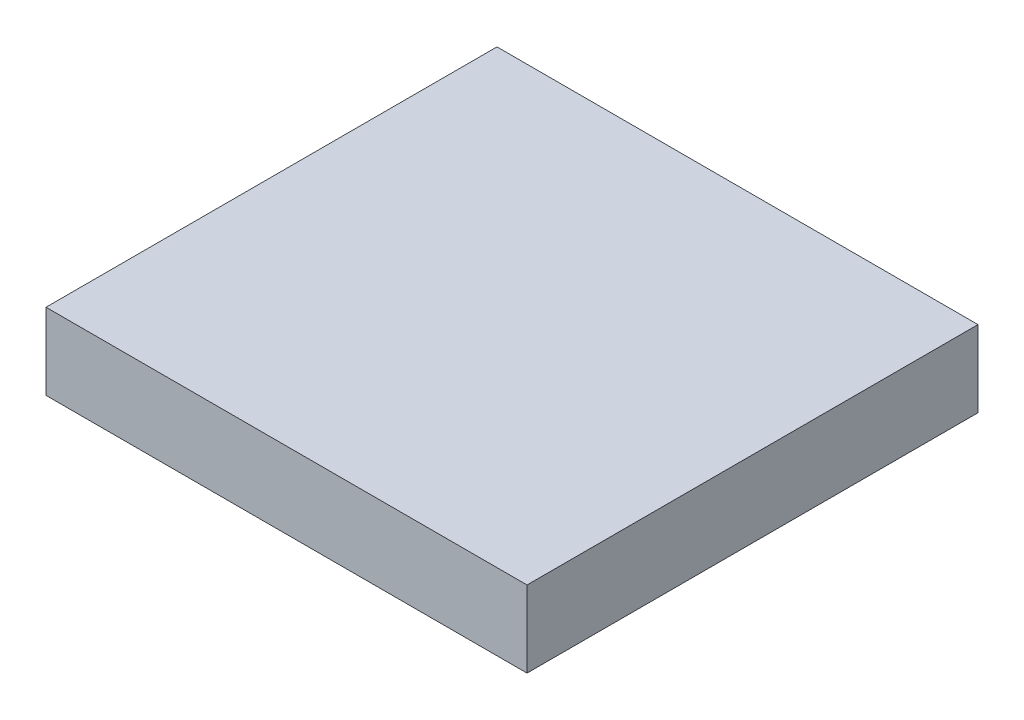
ISO-10303-21;
HEADER;
FILE_DESCRIPTION(('STEP AP214'),'2;1');
FILE_NAME('part.step','',(''),(''),'','','');
FILE_SCHEMA(('AUTOMOTIVE_DESIGN { 1 0 10303 214 1 1 1 1 }'));
ENDSEC;
DATA;
#1=APPLICATION_CONTEXT('core data for automotive mechanical design processes');
#2=APPLICATION_PROTOCOL_DEFINITION('international standard','automotive_design',2000,#1);
#3=PRODUCT_CONTEXT('',#1,'mechanical');
#4=PRODUCT('Part','Part','',(#3));
#5=PRODUCT_RELATED_PRODUCT_CATEGORY('part','',(#4));
#6=PRODUCT_DEFINITION_FORMATION('','',#4);
#7=PRODUCT_DEFINITION_CONTEXT('part definition',#1,'design');
#8=PRODUCT_DEFINITION('design','',#6,#7);
#9=PRODUCT_DEFINITION_SHAPE('','',#8);
#10=(LENGTH_UNIT() NAMED_UNIT(*) SI_UNIT(.MILLI.,.METRE.));
#11=(NAMED_UNIT(*) PLANE_ANGLE_UNIT() SI_UNIT($,.RADIAN.));
#12=(NAMED_UNIT(*) SI_UNIT($,.STERADIAN.) SOLID_ANGLE_UNIT());
#13=UNCERTAINTY_MEASURE_WITH_UNIT(LENGTH_MEASURE(1.E-05),#10,'distance_accuracy_value','');
#14=(GEOMETRIC_REPRESENTATION_CONTEXT(3) GLOBAL_UNCERTAINTY_ASSIGNED_CONTEXT((#13)) GLOBAL_UNIT_ASSIGNED_CONTEXT((#10,
#11,#12)) REPRESENTATION_CONTEXT('',''));
#15=CARTESIAN_POINT('',(0.,0.,0.));
#16=DIRECTION('',(0.,0.,1.));
#17=DIRECTION('',(1.,0.,0.));
#18=AXIS2_PLACEMENT_3D('',#15,#16,#17);
#19=CARTESIAN_POINT('',(0.,15.24,0.));
#20=DIRECTION('',(1.,0.,0.));
#21=DIRECTION('',(0.,0.,-1.));
#22=AXIS2_PLACEMENT_3D('',#19,#20,#21);
#23=PLANE('',#22);
#24=DIRECTION('',(0.,0.,1.));
#25=VECTOR('',#24,1.);
#26=CARTESIAN_POINT('',(0.,0.,0.));
#27=LINE('',#26,#25);
#28=CARTESIAN_POINT('',(0.,0.,-90.));
#29=VERTEX_POINT('',#28);
#30=CARTESIAN_POINT('',(0.,0.,0.));
#31=VERTEX_POINT('',#30);
#32=EDGE_CURVE('E107',#29,#31,#27,.T.);
#33=ORIENTED_EDGE('',*,*,#32,.T.);
#34=DIRECTION('',(0.,-1.,0.));
#35=VECTOR('',#34,1.);
#36=CARTESIAN_POINT('',(0.,15.24,0.));
#37=LINE('',#36,#35);
#38=CARTESIAN_POINT('',(0.,15.24,0.));
#39=VERTEX_POINT('',#38);
#40=EDGE_CURVE('E11',#39,#31,#37,.T.);
#41=ORIENTED_EDGE('',*,*,#40,.F.);
#42=DIRECTION('',(0.,0.,1.));
#43=VECTOR('',#42,1.);
#44=CARTESIAN_POINT('',(0.,15.24,0.));
#45=LINE('',#44,#43);
#46=CARTESIAN_POINT('',(0.,15.24,-90.));
#47=VERTEX_POINT('',#46);
#48=EDGE_CURVE('E95',#47,#39,#45,.T.);
#49=ORIENTED_EDGE('',*,*,#48,.F.);
#50=DIRECTION('',(0.,-1.,0.));
#51=VECTOR('',#50,1.);
#52=CARTESIAN_POINT('',(0.,15.24,-90.));
#53=LINE('',#52,#51);
#54=EDGE_CURVE('E103',#47,#29,#53,.T.);
#55=ORIENTED_EDGE('',*,*,#54,.T.);
#56=EDGE_LOOP('',(#33,#41,#49,#55));
#57=FACE_BOUND('',#56,.T.);
#58=ADVANCED_FACE('F44',(#57),#23,.F.);
#59=CARTESIAN_POINT('',(0.,15.24,0.));
#60=DIRECTION('',(0.,0.,-1.));
#61=DIRECTION('',(-1.,0.,0.));
#62=AXIS2_PLACEMENT_3D('',#59,#60,#61);
#63=PLANE('',#62);
#64=DIRECTION('',(1.,0.,0.));
#65=VECTOR('',#64,1.);
#66=CARTESIAN_POINT('',(0.,0.,0.));
#67=LINE('',#66,#65);
#68=CARTESIAN_POINT('',(96.,0.,0.));
#69=VERTEX_POINT('',#68);
#70=EDGE_CURVE('E99',#31,#69,#67,.T.);
#71=ORIENTED_EDGE('',*,*,#70,.T.);
#72=DIRECTION('',(0.,-1.,0.));
#73=VECTOR('',#72,1.);
#74=CARTESIAN_POINT('',(96.,15.24,0.));
#75=LINE('',#74,#73);
#76=CARTESIAN_POINT('',(96.,15.24,0.));
#77=VERTEX_POINT('',#76);
#78=EDGE_CURVE('E52',#77,#69,#75,.T.);
#79=ORIENTED_EDGE('',*,*,#78,.F.);
#80=DIRECTION('',(1.,0.,0.));
#81=VECTOR('',#80,1.);
#82=CARTESIAN_POINT('',(0.,15.24,0.));
#83=LINE('',#82,#81);
#84=EDGE_CURVE('E90',#39,#77,#83,.T.);
#85=ORIENTED_EDGE('',*,*,#84,.F.);
#86=ORIENTED_EDGE('',*,*,#40,.T.);
#87=EDGE_LOOP('',(#71,#79,#85,#86));
#88=FACE_BOUND('',#87,.T.);
#89=ADVANCED_FACE('F98',(#88),#63,.F.);
#90=CARTESIAN_POINT('',(96.,15.24,0.));
#91=DIRECTION('',(-1.,0.,0.));
#92=DIRECTION('',(0.,0.,1.));
#93=AXIS2_PLACEMENT_3D('',#90,#91,#92);
#94=PLANE('',#93);
#95=DIRECTION('',(0.,0.,-1.));
#96=VECTOR('',#95,1.);
#97=CARTESIAN_POINT('',(96.,0.,0.));
#98=LINE('',#97,#96);
#99=CARTESIAN_POINT('',(96.,0.,-90.));
#100=VERTEX_POINT('',#99);
#101=EDGE_CURVE('E77',#69,#100,#98,.T.);
#102=ORIENTED_EDGE('',*,*,#101,.T.);
#103=DIRECTION('',(0.,-1.,0.));
#104=VECTOR('',#103,1.);
#105=CARTESIAN_POINT('',(96.,15.24,-90.));
#106=LINE('',#105,#104);
#107=CARTESIAN_POINT('',(96.,15.24,-90.));
#108=VERTEX_POINT('',#107);
#109=EDGE_CURVE('E100',#108,#100,#106,.T.);
#110=ORIENTED_EDGE('',*,*,#109,.F.);
#111=DIRECTION('',(0.,0.,-1.));
#112=VECTOR('',#111,1.);
#113=CARTESIAN_POINT('',(96.,15.24,0.));
#114=LINE('',#113,#112);
#115=EDGE_CURVE('E93',#77,#108,#114,.T.);
#116=ORIENTED_EDGE('',*,*,#115,.F.);
#117=ORIENTED_EDGE('',*,*,#78,.T.);
#118=EDGE_LOOP('',(#102,#110,#116,#117));
#119=FACE_BOUND('',#118,.T.);
#120=ADVANCED_FACE('F101',(#119),#94,.F.);
#121=CARTESIAN_POINT('',(0.,15.24,-90.));
#122=DIRECTION('',(0.,0.,1.));
#123=DIRECTION('',(1.,0.,0.));
#124=AXIS2_PLACEMENT_3D('',#121,#122,#123);
#125=PLANE('',#124);
#126=DIRECTION('',(-1.,0.,0.));
#127=VECTOR('',#126,1.);
#128=CARTESIAN_POINT('',(0.,0.,-90.));
#129=LINE('',#128,#127);
#130=EDGE_CURVE('E83',#100,#29,#129,.T.);
#131=ORIENTED_EDGE('',*,*,#130,.T.);
#132=ORIENTED_EDGE('',*,*,#54,.F.);
#133=DIRECTION('',(-1.,0.,0.));
#134=VECTOR('',#133,1.);
#135=CARTESIAN_POINT('',(0.,15.24,-90.));
#136=LINE('',#135,#134);
#137=EDGE_CURVE('E60',#108,#47,#136,.T.);
#138=ORIENTED_EDGE('',*,*,#137,.F.);
#139=ORIENTED_EDGE('',*,*,#109,.T.);
#140=EDGE_LOOP('',(#131,#132,#138,#139));
#141=FACE_BOUND('',#140,.T.);
#142=ADVANCED_FACE('F114',(#141),#125,.F.);
#143=CARTESIAN_POINT('',(0.,15.24,0.));
#144=DIRECTION('',(0.,-1.,0.));
#145=DIRECTION('',(0.,0.,-1.));
#146=AXIS2_PLACEMENT_3D('',#143,#144,#145);
#147=PLANE('',#146);
#148=ORIENTED_EDGE('',*,*,#48,.T.);
#149=ORIENTED_EDGE('',*,*,#84,.T.);
#150=ORIENTED_EDGE('',*,*,#115,.T.);
#151=ORIENTED_EDGE('',*,*,#137,.T.);
#152=EDGE_LOOP('',(#148,#149,#150,#151));
#153=FACE_BOUND('',#152,.T.);
#154=ADVANCED_FACE('F91',(#153),#147,.F.);
#155=CARTESIAN_POINT('',(0.,0.,0.));
#156=DIRECTION('',(0.,-1.,0.));
#157=DIRECTION('',(0.,0.,-1.));
#158=AXIS2_PLACEMENT_3D('',#155,#156,#157);
#159=PLANE('',#158);
#160=ORIENTED_EDGE('',*,*,#32,.F.);
#161=ORIENTED_EDGE('',*,*,#130,.F.);
#162=ORIENTED_EDGE('',*,*,#101,.F.);
#163=ORIENTED_EDGE('',*,*,#70,.F.);
#164=EDGE_LOOP('',(#160,#161,#162,#163));
#165=FACE_BOUND('',#164,.T.);
#166=ADVANCED_FACE('F117',(#165),#159,.T.);
#167=CLOSED_SHELL('',(#58,#89,#120,#142,#154,#166));
#168=MANIFOLD_SOLID_BREP('B2',#167);
#169=ADVANCED_BREP_SHAPE_REPRESENTATION('',(#18,#168),#14);
#170=SHAPE_DEFINITION_REPRESENTATION(#9,#169);
ENDSEC;
END-ISO-10303-21;
